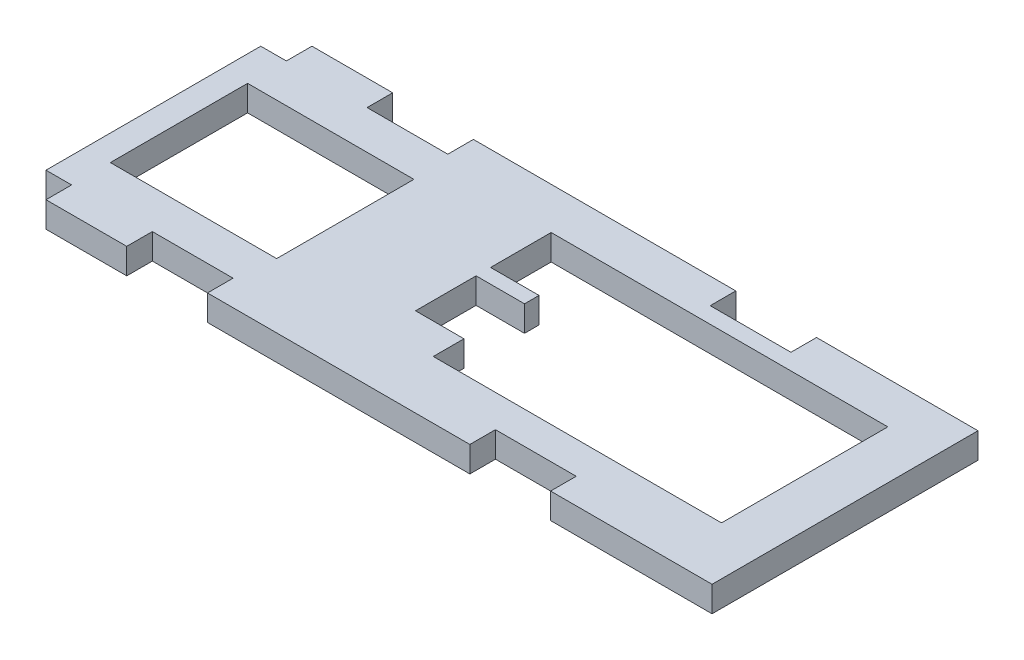
ISO-10303-21;
HEADER;
FILE_DESCRIPTION(('STEP AP214'),'2;1');
FILE_NAME('part.step','',(''),(''),'','','');
FILE_SCHEMA(('AUTOMOTIVE_DESIGN { 1 0 10303 214 1 1 1 1 }'));
ENDSEC;
DATA;
#1=APPLICATION_CONTEXT('core data for automotive mechanical design processes');
#2=APPLICATION_PROTOCOL_DEFINITION('international standard','automotive_design',2000,#1);
#3=PRODUCT_CONTEXT('',#1,'mechanical');
#4=PRODUCT('Part','Part','',(#3));
#5=PRODUCT_RELATED_PRODUCT_CATEGORY('part','',(#4));
#6=PRODUCT_DEFINITION_FORMATION('','',#4);
#7=PRODUCT_DEFINITION_CONTEXT('part definition',#1,'design');
#8=PRODUCT_DEFINITION('design','',#6,#7);
#9=PRODUCT_DEFINITION_SHAPE('','',#8);
#10=(LENGTH_UNIT() NAMED_UNIT(*) SI_UNIT(.MILLI.,.METRE.));
#11=(NAMED_UNIT(*) PLANE_ANGLE_UNIT() SI_UNIT($,.RADIAN.));
#12=(NAMED_UNIT(*) SI_UNIT($,.STERADIAN.) SOLID_ANGLE_UNIT());
#13=UNCERTAINTY_MEASURE_WITH_UNIT(LENGTH_MEASURE(1.E-05),#10,'distance_accuracy_value','');
#14=(GEOMETRIC_REPRESENTATION_CONTEXT(3) GLOBAL_UNCERTAINTY_ASSIGNED_CONTEXT((#13)) GLOBAL_UNIT_ASSIGNED_CONTEXT((#10,
#11,#12)) REPRESENTATION_CONTEXT('',''));
#15=CARTESIAN_POINT('',(0.,0.,0.));
#16=DIRECTION('',(0.,0.,1.));
#17=DIRECTION('',(1.,0.,0.));
#18=AXIS2_PLACEMENT_3D('',#15,#16,#17);
#19=CARTESIAN_POINT('',(0.,-3.17,-20.27));
#20=DIRECTION('',(0.,0.,-1.));
#21=DIRECTION('',(-1.,0.,0.));
#22=AXIS2_PLACEMENT_3D('',#19,#20,#21);
#23=PLANE('',#22);
#24=DIRECTION('',(-1.,0.,0.));
#25=VECTOR('',#24,1.);
#26=CARTESIAN_POINT('',(0.,0.,-20.27));
#27=LINE('',#26,#25);
#28=CARTESIAN_POINT('',(43.97,0.,-20.27));
#29=VERTEX_POINT('',#28);
#30=CARTESIAN_POINT('',(37.97,0.,-20.27));
#31=VERTEX_POINT('',#30);
#32=EDGE_CURVE('E387',#29,#31,#27,.T.);
#33=ORIENTED_EDGE('',*,*,#32,.F.);
#34=DIRECTION('',(0.,1.,0.));
#35=VECTOR('',#34,1.);
#36=CARTESIAN_POINT('',(43.97,-3.17,-20.27));
#37=LINE('',#36,#35);
#38=CARTESIAN_POINT('',(43.97,-3.17,-20.27));
#39=VERTEX_POINT('',#38);
#40=EDGE_CURVE('E11',#39,#29,#37,.T.);
#41=ORIENTED_EDGE('',*,*,#40,.F.);
#42=DIRECTION('',(-1.,0.,0.));
#43=VECTOR('',#42,1.);
#44=CARTESIAN_POINT('',(0.,-3.17,-20.27));
#45=LINE('',#44,#43);
#46=CARTESIAN_POINT('',(37.97,-3.17,-20.27));
#47=VERTEX_POINT('',#46);
#48=EDGE_CURVE('E504',#39,#47,#45,.T.);
#49=ORIENTED_EDGE('',*,*,#48,.T.);
#50=DIRECTION('',(0.,1.,0.));
#51=VECTOR('',#50,1.);
#52=CARTESIAN_POINT('',(37.97,-3.17,-20.27));
#53=LINE('',#52,#51);
#54=EDGE_CURVE('E425',#47,#31,#53,.T.);
#55=ORIENTED_EDGE('',*,*,#54,.T.);
#56=EDGE_LOOP('',(#33,#41,#49,#55));
#57=FACE_BOUND('',#56,.T.);
#58=ADVANCED_FACE('F35',(#57),#23,.T.);
#59=CARTESIAN_POINT('',(43.97,-3.17,0.));
#60=DIRECTION('',(-1.,0.,0.));
#61=DIRECTION('',(0.,0.,1.));
#62=AXIS2_PLACEMENT_3D('',#59,#60,#61);
#63=PLANE('',#62);
#64=DIRECTION('',(0.,0.,1.));
#65=VECTOR('',#64,1.);
#66=CARTESIAN_POINT('',(43.97,0.,0.));
#67=LINE('',#66,#65);
#68=CARTESIAN_POINT('',(43.97,0.,-18.47));
#69=VERTEX_POINT('',#68);
#70=EDGE_CURVE('E406',#29,#69,#67,.T.);
#71=ORIENTED_EDGE('',*,*,#70,.T.);
#72=DIRECTION('',(0.,1.,0.));
#73=VECTOR('',#72,1.);
#74=CARTESIAN_POINT('',(43.97,-3.17,-18.47));
#75=LINE('',#74,#73);
#76=CARTESIAN_POINT('',(43.97,-3.17,-18.47));
#77=VERTEX_POINT('',#76);
#78=EDGE_CURVE('E45',#77,#69,#75,.T.);
#79=ORIENTED_EDGE('',*,*,#78,.F.);
#80=DIRECTION('',(0.,0.,1.));
#81=VECTOR('',#80,1.);
#82=CARTESIAN_POINT('',(43.97,-3.17,0.));
#83=LINE('',#82,#81);
#84=EDGE_CURVE('E297',#39,#77,#83,.T.);
#85=ORIENTED_EDGE('',*,*,#84,.F.);
#86=ORIENTED_EDGE('',*,*,#40,.T.);
#87=EDGE_LOOP('',(#71,#79,#85,#86));
#88=FACE_BOUND('',#87,.T.);
#89=ADVANCED_FACE('F573',(#88),#63,.F.);
#90=CARTESIAN_POINT('',(0.,-3.17,-18.47));
#91=DIRECTION('',(0.,0.,-1.));
#92=DIRECTION('',(-1.,0.,0.));
#93=AXIS2_PLACEMENT_3D('',#90,#91,#92);
#94=PLANE('',#93);
#95=DIRECTION('',(-1.,0.,0.));
#96=VECTOR('',#95,1.);
#97=CARTESIAN_POINT('',(0.,0.,-18.47));
#98=LINE('',#97,#96);
#99=CARTESIAN_POINT('',(37.97,0.,-18.47));
#100=VERTEX_POINT('',#99);
#101=EDGE_CURVE('E172',#69,#100,#98,.T.);
#102=ORIENTED_EDGE('',*,*,#101,.T.);
#103=DIRECTION('',(0.,1.,0.));
#104=VECTOR('',#103,1.);
#105=CARTESIAN_POINT('',(37.97,-3.17,-18.47));
#106=LINE('',#105,#104);
#107=CARTESIAN_POINT('',(37.97,-3.17,-18.47));
#108=VERTEX_POINT('',#107);
#109=EDGE_CURVE('E301',#108,#100,#106,.T.);
#110=ORIENTED_EDGE('',*,*,#109,.F.);
#111=DIRECTION('',(-1.,0.,0.));
#112=VECTOR('',#111,1.);
#113=CARTESIAN_POINT('',(0.,-3.17,-18.47));
#114=LINE('',#113,#112);
#115=EDGE_CURVE('E289',#77,#108,#114,.T.);
#116=ORIENTED_EDGE('',*,*,#115,.F.);
#117=ORIENTED_EDGE('',*,*,#78,.T.);
#118=EDGE_LOOP('',(#102,#110,#116,#117));
#119=FACE_BOUND('',#118,.T.);
#120=ADVANCED_FACE('F302',(#119),#94,.F.);
#121=CARTESIAN_POINT('',(37.97,-3.17,0.));
#122=DIRECTION('',(1.,0.,0.));
#123=DIRECTION('',(0.,0.,-1.));
#124=AXIS2_PLACEMENT_3D('',#121,#122,#123);
#125=PLANE('',#124);
#126=DIRECTION('',(0.,0.,-1.));
#127=VECTOR('',#126,1.);
#128=CARTESIAN_POINT('',(37.97,0.,0.));
#129=LINE('',#128,#127);
#130=CARTESIAN_POINT('',(37.97,0.,-10.97));
#131=VERTEX_POINT('',#130);
#132=EDGE_CURVE('E409',#131,#100,#129,.T.);
#133=ORIENTED_EDGE('',*,*,#132,.F.);
#134=DIRECTION('',(0.,1.,0.));
#135=VECTOR('',#134,1.);
#136=CARTESIAN_POINT('',(37.97,-3.17,-10.97));
#137=LINE('',#136,#135);
#138=CARTESIAN_POINT('',(37.97,-3.17,-10.97));
#139=VERTEX_POINT('',#138);
#140=EDGE_CURVE('E305',#139,#131,#137,.T.);
#141=ORIENTED_EDGE('',*,*,#140,.F.);
#142=DIRECTION('',(0.,0.,-1.));
#143=VECTOR('',#142,1.);
#144=CARTESIAN_POINT('',(37.97,-3.17,0.));
#145=LINE('',#144,#143);
#146=EDGE_CURVE('E295',#139,#108,#145,.T.);
#147=ORIENTED_EDGE('',*,*,#146,.T.);
#148=ORIENTED_EDGE('',*,*,#109,.T.);
#149=EDGE_LOOP('',(#133,#141,#147,#148));
#150=FACE_BOUND('',#149,.T.);
#151=ADVANCED_FACE('F307',(#150),#125,.T.);
#152=CARTESIAN_POINT('',(0.,-3.17,-10.97));
#153=DIRECTION('',(0.,0.,-1.));
#154=DIRECTION('',(-1.,0.,0.));
#155=AXIS2_PLACEMENT_3D('',#152,#153,#154);
#156=PLANE('',#155);
#157=DIRECTION('',(-1.,0.,0.));
#158=VECTOR('',#157,1.);
#159=CARTESIAN_POINT('',(0.,0.,-10.97));
#160=LINE('',#159,#158);
#161=CARTESIAN_POINT('',(43.97,0.,-10.97));
#162=VERTEX_POINT('',#161);
#163=EDGE_CURVE('E405',#162,#131,#160,.T.);
#164=ORIENTED_EDGE('',*,*,#163,.F.);
#165=DIRECTION('',(0.,1.,0.));
#166=VECTOR('',#165,1.);
#167=CARTESIAN_POINT('',(43.97,-3.17,-10.97));
#168=LINE('',#167,#166);
#169=CARTESIAN_POINT('',(43.97,-3.17,-10.97));
#170=VERTEX_POINT('',#169);
#171=EDGE_CURVE('E414',#170,#162,#168,.T.);
#172=ORIENTED_EDGE('',*,*,#171,.F.);
#173=DIRECTION('',(-1.,0.,0.));
#174=VECTOR('',#173,1.);
#175=CARTESIAN_POINT('',(0.,-3.17,-10.97));
#176=LINE('',#175,#174);
#177=EDGE_CURVE('E308',#170,#139,#176,.T.);
#178=ORIENTED_EDGE('',*,*,#177,.T.);
#179=ORIENTED_EDGE('',*,*,#140,.T.);
#180=EDGE_LOOP('',(#164,#172,#178,#179));
#181=FACE_BOUND('',#180,.T.);
#182=ADVANCED_FACE('F592',(#181),#156,.T.);
#183=CARTESIAN_POINT('',(43.97,0.,-7.17));
#184=VERTEX_POINT('',#183);
#185=EDGE_CURVE('E402',#162,#184,#67,.T.);
#186=ORIENTED_EDGE('',*,*,#185,.T.);
#187=DIRECTION('',(0.,1.,0.));
#188=VECTOR('',#187,1.);
#189=CARTESIAN_POINT('',(43.97,-3.17,-7.17));
#190=LINE('',#189,#188);
#191=CARTESIAN_POINT('',(43.97,-3.17,-7.17));
#192=VERTEX_POINT('',#191);
#193=EDGE_CURVE('E416',#192,#184,#190,.T.);
#194=ORIENTED_EDGE('',*,*,#193,.F.);
#195=EDGE_CURVE('E310',#170,#192,#83,.T.);
#196=ORIENTED_EDGE('',*,*,#195,.F.);
#197=ORIENTED_EDGE('',*,*,#171,.T.);
#198=EDGE_LOOP('',(#186,#194,#196,#197));
#199=FACE_BOUND('',#198,.T.);
#200=ADVANCED_FACE('F593',(#199),#63,.F.);
#201=CARTESIAN_POINT('',(0.,-3.17,-7.17));
#202=DIRECTION('',(0.,0.,1.));
#203=DIRECTION('',(1.,0.,0.));
#204=AXIS2_PLACEMENT_3D('',#201,#202,#203);
#205=PLANE('',#204);
#206=DIRECTION('',(1.,0.,0.));
#207=VECTOR('',#206,1.);
#208=CARTESIAN_POINT('',(0.,0.,-7.17));
#209=LINE('',#208,#207);
#210=CARTESIAN_POINT('',(79.67,0.,-7.17));
#211=VERTEX_POINT('',#210);
#212=EDGE_CURVE('E399',#184,#211,#209,.T.);
#213=ORIENTED_EDGE('',*,*,#212,.T.);
#214=DIRECTION('',(0.,1.,0.));
#215=VECTOR('',#214,1.);
#216=CARTESIAN_POINT('',(79.67,-3.17,-7.17));
#217=LINE('',#216,#215);
#218=CARTESIAN_POINT('',(79.67,-3.17,-7.17));
#219=VERTEX_POINT('',#218);
#220=EDGE_CURVE('E419',#219,#211,#217,.T.);
#221=ORIENTED_EDGE('',*,*,#220,.F.);
#222=DIRECTION('',(1.,0.,0.));
#223=VECTOR('',#222,1.);
#224=CARTESIAN_POINT('',(0.,-3.17,-7.17));
#225=LINE('',#224,#223);
#226=EDGE_CURVE('E490',#192,#219,#225,.T.);
#227=ORIENTED_EDGE('',*,*,#226,.F.);
#228=ORIENTED_EDGE('',*,*,#193,.T.);
#229=EDGE_LOOP('',(#213,#221,#227,#228));
#230=FACE_BOUND('',#229,.T.);
#231=ADVANCED_FACE('F587',(#230),#205,.F.);
#232=CARTESIAN_POINT('',(79.67,-3.17,0.));
#233=DIRECTION('',(-1.,0.,0.));
#234=DIRECTION('',(0.,0.,1.));
#235=AXIS2_PLACEMENT_3D('',#232,#233,#234);
#236=PLANE('',#235);
#237=DIRECTION('',(0.,0.,1.));
#238=VECTOR('',#237,1.);
#239=CARTESIAN_POINT('',(79.67,0.,0.));
#240=LINE('',#239,#238);
#241=CARTESIAN_POINT('',(79.67,0.,-27.77));
#242=VERTEX_POINT('',#241);
#243=EDGE_CURVE('E396',#242,#211,#240,.T.);
#244=ORIENTED_EDGE('',*,*,#243,.F.);
#245=DIRECTION('',(0.,1.,0.));
#246=VECTOR('',#245,1.);
#247=CARTESIAN_POINT('',(79.67,-3.17,-27.77));
#248=LINE('',#247,#246);
#249=CARTESIAN_POINT('',(79.67,-3.17,-27.77));
#250=VERTEX_POINT('',#249);
#251=EDGE_CURVE('E421',#250,#242,#248,.T.);
#252=ORIENTED_EDGE('',*,*,#251,.F.);
#253=DIRECTION('',(0.,0.,1.));
#254=VECTOR('',#253,1.);
#255=CARTESIAN_POINT('',(79.67,-3.17,0.));
#256=LINE('',#255,#254);
#257=EDGE_CURVE('E493',#250,#219,#256,.T.);
#258=ORIENTED_EDGE('',*,*,#257,.T.);
#259=ORIENTED_EDGE('',*,*,#220,.T.);
#260=EDGE_LOOP('',(#244,#252,#258,#259));
#261=FACE_BOUND('',#260,.T.);
#262=ADVANCED_FACE('F584',(#261),#236,.T.);
#263=CARTESIAN_POINT('',(0.,-3.17,-27.77));
#264=DIRECTION('',(0.,0.,-1.));
#265=DIRECTION('',(-1.,0.,0.));
#266=AXIS2_PLACEMENT_3D('',#263,#264,#265);
#267=PLANE('',#266);
#268=DIRECTION('',(-1.,0.,0.));
#269=VECTOR('',#268,1.);
#270=CARTESIAN_POINT('',(0.,0.,-27.77));
#271=LINE('',#270,#269);
#272=CARTESIAN_POINT('',(37.97,0.,-27.77));
#273=VERTEX_POINT('',#272);
#274=EDGE_CURVE('E393',#242,#273,#271,.T.);
#275=ORIENTED_EDGE('',*,*,#274,.T.);
#276=DIRECTION('',(0.,1.,0.));
#277=VECTOR('',#276,1.);
#278=CARTESIAN_POINT('',(37.97,-3.17,-27.77));
#279=LINE('',#278,#277);
#280=CARTESIAN_POINT('',(37.97,-3.17,-27.77));
#281=VERTEX_POINT('',#280);
#282=EDGE_CURVE('E423',#281,#273,#279,.T.);
#283=ORIENTED_EDGE('',*,*,#282,.F.);
#284=DIRECTION('',(-1.,0.,0.));
#285=VECTOR('',#284,1.);
#286=CARTESIAN_POINT('',(0.,-3.17,-27.77));
#287=LINE('',#286,#285);
#288=EDGE_CURVE('E497',#250,#281,#287,.T.);
#289=ORIENTED_EDGE('',*,*,#288,.F.);
#290=ORIENTED_EDGE('',*,*,#251,.T.);
#291=EDGE_LOOP('',(#275,#283,#289,#290));
#292=FACE_BOUND('',#291,.T.);
#293=ADVANCED_FACE('F629',(#292),#267,.F.);
#294=CARTESIAN_POINT('',(0.,-3.17,-24.97));
#295=DIRECTION('',(0.,0.,1.));
#296=DIRECTION('',(1.,0.,0.));
#297=AXIS2_PLACEMENT_3D('',#294,#295,#296);
#298=PLANE('',#297);
#299=DIRECTION('',(1.,0.,0.));
#300=VECTOR('',#299,1.);
#301=CARTESIAN_POINT('',(0.,0.,-24.97));
#302=LINE('',#301,#300);
#303=CARTESIAN_POINT('',(3.17,0.,-24.97));
#304=VERTEX_POINT('',#303);
#305=CARTESIAN_POINT('',(23.77,0.,-24.97));
#306=VERTEX_POINT('',#305);
#307=EDGE_CURVE('E375',#304,#306,#302,.T.);
#308=ORIENTED_EDGE('',*,*,#307,.F.);
#309=DIRECTION('',(0.,1.,0.));
#310=VECTOR('',#309,1.);
#311=CARTESIAN_POINT('',(3.17,-3.17,-24.97));
#312=LINE('',#311,#310);
#313=CARTESIAN_POINT('',(3.17,-3.17,-24.97));
#314=VERTEX_POINT('',#313);
#315=EDGE_CURVE('E427',#314,#304,#312,.T.);
#316=ORIENTED_EDGE('',*,*,#315,.F.);
#317=DIRECTION('',(1.,0.,0.));
#318=VECTOR('',#317,1.);
#319=CARTESIAN_POINT('',(0.,-3.17,-24.97));
#320=LINE('',#319,#318);
#321=CARTESIAN_POINT('',(23.77,-3.17,-24.97));
#322=VERTEX_POINT('',#321);
#323=EDGE_CURVE('E514',#314,#322,#320,.T.);
#324=ORIENTED_EDGE('',*,*,#323,.T.);
#325=DIRECTION('',(0.,1.,0.));
#326=VECTOR('',#325,1.);
#327=CARTESIAN_POINT('',(23.77,-3.17,-24.97));
#328=LINE('',#327,#326);
#329=EDGE_CURVE('E434',#322,#306,#328,.T.);
#330=ORIENTED_EDGE('',*,*,#329,.T.);
#331=EDGE_LOOP('',(#308,#316,#324,#330));
#332=FACE_BOUND('',#331,.T.);
#333=ADVANCED_FACE('F616',(#332),#298,.T.);
#334=CARTESIAN_POINT('',(3.17,-3.17,0.));
#335=DIRECTION('',(-1.,0.,0.));
#336=DIRECTION('',(0.,0.,1.));
#337=AXIS2_PLACEMENT_3D('',#334,#335,#336);
#338=PLANE('',#337);
#339=DIRECTION('',(0.,0.,1.));
#340=VECTOR('',#339,1.);
#341=CARTESIAN_POINT('',(3.17,0.,0.));
#342=LINE('',#341,#340);
#343=CARTESIAN_POINT('',(3.17,0.,-7.97));
#344=VERTEX_POINT('',#343);
#345=EDGE_CURVE('E384',#304,#344,#342,.T.);
#346=ORIENTED_EDGE('',*,*,#345,.T.);
#347=DIRECTION('',(0.,1.,0.));
#348=VECTOR('',#347,1.);
#349=CARTESIAN_POINT('',(3.17,-3.17,-7.97));
#350=LINE('',#349,#348);
#351=CARTESIAN_POINT('',(3.17,-3.17,-7.97));
#352=VERTEX_POINT('',#351);
#353=EDGE_CURVE('E429',#352,#344,#350,.T.);
#354=ORIENTED_EDGE('',*,*,#353,.F.);
#355=DIRECTION('',(0.,0.,1.));
#356=VECTOR('',#355,1.);
#357=CARTESIAN_POINT('',(3.17,-3.17,0.));
#358=LINE('',#357,#356);
#359=EDGE_CURVE('E506',#314,#352,#358,.T.);
#360=ORIENTED_EDGE('',*,*,#359,.F.);
#361=ORIENTED_EDGE('',*,*,#315,.T.);
#362=EDGE_LOOP('',(#346,#354,#360,#361));
#363=FACE_BOUND('',#362,.T.);
#364=ADVANCED_FACE('F612',(#363),#338,.F.);
#365=CARTESIAN_POINT('',(0.,-3.17,-7.97));
#366=DIRECTION('',(0.,0.,1.));
#367=DIRECTION('',(1.,0.,0.));
#368=AXIS2_PLACEMENT_3D('',#365,#366,#367);
#369=PLANE('',#368);
#370=DIRECTION('',(1.,0.,0.));
#371=VECTOR('',#370,1.);
#372=CARTESIAN_POINT('',(0.,0.,-7.97));
#373=LINE('',#372,#371);
#374=CARTESIAN_POINT('',(23.77,0.,-7.97));
#375=VERTEX_POINT('',#374);
#376=EDGE_CURVE('E381',#344,#375,#373,.T.);
#377=ORIENTED_EDGE('',*,*,#376,.T.);
#378=DIRECTION('',(0.,1.,0.));
#379=VECTOR('',#378,1.);
#380=CARTESIAN_POINT('',(23.77,-3.17,-7.97));
#381=LINE('',#380,#379);
#382=CARTESIAN_POINT('',(23.77,-3.17,-7.97));
#383=VERTEX_POINT('',#382);
#384=EDGE_CURVE('E432',#383,#375,#381,.T.);
#385=ORIENTED_EDGE('',*,*,#384,.F.);
#386=DIRECTION('',(1.,0.,0.));
#387=VECTOR('',#386,1.);
#388=CARTESIAN_POINT('',(0.,-3.17,-7.97));
#389=LINE('',#388,#387);
#390=EDGE_CURVE('E509',#352,#383,#389,.T.);
#391=ORIENTED_EDGE('',*,*,#390,.F.);
#392=ORIENTED_EDGE('',*,*,#353,.T.);
#393=EDGE_LOOP('',(#377,#385,#391,#392));
#394=FACE_BOUND('',#393,.T.);
#395=ADVANCED_FACE('F615',(#394),#369,.F.);
#396=CARTESIAN_POINT('',(3.17,-3.17,0.));
#397=DIRECTION('',(1.,0.,0.));
#398=DIRECTION('',(0.,0.,-1.));
#399=AXIS2_PLACEMENT_3D('',#396,#397,#398);
#400=PLANE('',#399);
#401=DIRECTION('',(0.,0.,-1.));
#402=VECTOR('',#401,1.);
#403=CARTESIAN_POINT('',(3.17,0.,0.));
#404=LINE('',#403,#402);
#405=CARTESIAN_POINT('',(3.17,0.,0.));
#406=VERTEX_POINT('',#405);
#407=CARTESIAN_POINT('',(3.17,0.,-3.17));
#408=VERTEX_POINT('',#407);
#409=EDGE_CURVE('E314',#406,#408,#404,.T.);
#410=ORIENTED_EDGE('',*,*,#409,.T.);
#411=DIRECTION('',(0.,1.,0.));
#412=VECTOR('',#411,1.);
#413=CARTESIAN_POINT('',(3.17,-3.17,-3.17));
#414=LINE('',#413,#412);
#415=CARTESIAN_POINT('',(3.17,-3.17,-3.17));
#416=VERTEX_POINT('',#415);
#417=EDGE_CURVE('E436',#416,#408,#414,.T.);
#418=ORIENTED_EDGE('',*,*,#417,.F.);
#419=DIRECTION('',(0.,0.,-1.));
#420=VECTOR('',#419,1.);
#421=CARTESIAN_POINT('',(3.17,-3.17,0.));
#422=LINE('',#421,#420);
#423=CARTESIAN_POINT('',(3.17,-3.17,0.));
#424=VERTEX_POINT('',#423);
#425=EDGE_CURVE('E568',#424,#416,#422,.T.);
#426=ORIENTED_EDGE('',*,*,#425,.F.);
#427=DIRECTION('',(0.,1.,0.));
#428=VECTOR('',#427,1.);
#429=CARTESIAN_POINT('',(3.17,-3.17,0.));
#430=LINE('',#429,#428);
#431=EDGE_CURVE('E39',#424,#406,#430,.T.);
#432=ORIENTED_EDGE('',*,*,#431,.T.);
#433=EDGE_LOOP('',(#410,#418,#426,#432));
#434=FACE_BOUND('',#433,.T.);
#435=ADVANCED_FACE('F37',(#434),#400,.F.);
#436=CARTESIAN_POINT('',(0.,-3.17,-3.17));
#437=DIRECTION('',(0.,0.,1.));
#438=DIRECTION('',(1.,0.,0.));
#439=AXIS2_PLACEMENT_3D('',#436,#437,#438);
#440=PLANE('',#439);
#441=DIRECTION('',(1.,0.,0.));
#442=VECTOR('',#441,1.);
#443=CARTESIAN_POINT('',(0.,0.,-3.17));
#444=LINE('',#443,#442);
#445=CARTESIAN_POINT('',(0.,0.,-3.17));
#446=VERTEX_POINT('',#445);
#447=EDGE_CURVE('E372',#446,#408,#444,.T.);
#448=ORIENTED_EDGE('',*,*,#447,.F.);
#449=DIRECTION('',(0.,1.,0.));
#450=VECTOR('',#449,1.);
#451=CARTESIAN_POINT('',(0.,-3.17,-3.17));
#452=LINE('',#451,#450);
#453=CARTESIAN_POINT('',(0.,-3.17,-3.17));
#454=VERTEX_POINT('',#453);
#455=EDGE_CURVE('E438',#454,#446,#452,.T.);
#456=ORIENTED_EDGE('',*,*,#455,.F.);
#457=DIRECTION('',(1.,0.,0.));
#458=VECTOR('',#457,1.);
#459=CARTESIAN_POINT('',(0.,-3.17,-3.17));
#460=LINE('',#459,#458);
#461=EDGE_CURVE('E517',#454,#416,#460,.T.);
#462=ORIENTED_EDGE('',*,*,#461,.T.);
#463=ORIENTED_EDGE('',*,*,#417,.T.);
#464=EDGE_LOOP('',(#448,#456,#462,#463));
#465=FACE_BOUND('',#464,.T.);
#466=ADVANCED_FACE('F631',(#465),#440,.T.);
#467=CARTESIAN_POINT('',(0.,-3.17,0.));
#468=DIRECTION('',(1.,0.,0.));
#469=DIRECTION('',(0.,0.,-1.));
#470=AXIS2_PLACEMENT_3D('',#467,#468,#469);
#471=PLANE('',#470);
#472=DIRECTION('',(0.,0.,-1.));
#473=VECTOR('',#472,1.);
#474=CARTESIAN_POINT('',(0.,0.,0.));
#475=LINE('',#474,#473);
#476=CARTESIAN_POINT('',(0.,0.,-29.77));
#477=VERTEX_POINT('',#476);
#478=EDGE_CURVE('E370',#446,#477,#475,.T.);
#479=ORIENTED_EDGE('',*,*,#478,.T.);
#480=DIRECTION('',(0.,1.,0.));
#481=VECTOR('',#480,1.);
#482=CARTESIAN_POINT('',(0.,-3.17,-29.77));
#483=LINE('',#482,#481);
#484=CARTESIAN_POINT('',(0.,-3.17,-29.77));
#485=VERTEX_POINT('',#484);
#486=EDGE_CURVE('E440',#485,#477,#483,.T.);
#487=ORIENTED_EDGE('',*,*,#486,.F.);
#488=DIRECTION('',(0.,0.,-1.));
#489=VECTOR('',#488,1.);
#490=CARTESIAN_POINT('',(0.,-3.17,0.));
#491=LINE('',#490,#489);
#492=EDGE_CURVE('E520',#454,#485,#491,.T.);
#493=ORIENTED_EDGE('',*,*,#492,.F.);
#494=ORIENTED_EDGE('',*,*,#455,.T.);
#495=EDGE_LOOP('',(#479,#487,#493,#494));
#496=FACE_BOUND('',#495,.T.);
#497=ADVANCED_FACE('F634',(#496),#471,.F.);
#498=CARTESIAN_POINT('',(0.,-3.17,-29.77));
#499=DIRECTION('',(0.,0.,1.));
#500=DIRECTION('',(1.,0.,0.));
#501=AXIS2_PLACEMENT_3D('',#498,#499,#500);
#502=PLANE('',#501);
#503=DIRECTION('',(1.,0.,0.));
#504=VECTOR('',#503,1.);
#505=CARTESIAN_POINT('',(0.,0.,-29.77));
#506=LINE('',#505,#504);
#507=CARTESIAN_POINT('',(3.17,0.,-29.77));
#508=VERTEX_POINT('',#507);
#509=EDGE_CURVE('E367',#477,#508,#506,.T.);
#510=ORIENTED_EDGE('',*,*,#509,.T.);
#511=DIRECTION('',(0.,1.,0.));
#512=VECTOR('',#511,1.);
#513=CARTESIAN_POINT('',(3.17,-3.17,-29.77));
#514=LINE('',#513,#512);
#515=CARTESIAN_POINT('',(3.17,-3.17,-29.77));
#516=VERTEX_POINT('',#515);
#517=EDGE_CURVE('E443',#516,#508,#514,.T.);
#518=ORIENTED_EDGE('',*,*,#517,.F.);
#519=DIRECTION('',(1.,0.,0.));
#520=VECTOR('',#519,1.);
#521=CARTESIAN_POINT('',(0.,-3.17,-29.77));
#522=LINE('',#521,#520);
#523=EDGE_CURVE('E522',#485,#516,#522,.T.);
#524=ORIENTED_EDGE('',*,*,#523,.F.);
#525=ORIENTED_EDGE('',*,*,#486,.T.);
#526=EDGE_LOOP('',(#510,#518,#524,#525));
#527=FACE_BOUND('',#526,.T.);
#528=ADVANCED_FACE('F638',(#527),#502,.F.);
#529=CARTESIAN_POINT('',(3.17,-3.17,0.));
#530=DIRECTION('',(-1.,0.,0.));
#531=DIRECTION('',(0.,0.,1.));
#532=AXIS2_PLACEMENT_3D('',#529,#530,#531);
#533=PLANE('',#532);
#534=DIRECTION('',(0.,0.,1.));
#535=VECTOR('',#534,1.);
#536=CARTESIAN_POINT('',(3.17,0.,0.));
#537=LINE('',#536,#535);
#538=CARTESIAN_POINT('',(3.17,0.,-32.94));
#539=VERTEX_POINT('',#538);
#540=EDGE_CURVE('E364',#539,#508,#537,.T.);
#541=ORIENTED_EDGE('',*,*,#540,.F.);
#542=DIRECTION('',(0.,1.,0.));
#543=VECTOR('',#542,1.);
#544=CARTESIAN_POINT('',(3.17,-3.17,-32.94));
#545=LINE('',#544,#543);
#546=CARTESIAN_POINT('',(3.17,-3.17,-32.94));
#547=VERTEX_POINT('',#546);
#548=EDGE_CURVE('E445',#547,#539,#545,.T.);
#549=ORIENTED_EDGE('',*,*,#548,.F.);
#550=DIRECTION('',(0.,0.,1.));
#551=VECTOR('',#550,1.);
#552=CARTESIAN_POINT('',(3.17,-3.17,0.));
#553=LINE('',#552,#551);
#554=EDGE_CURVE('E524',#547,#516,#553,.T.);
#555=ORIENTED_EDGE('',*,*,#554,.T.);
#556=ORIENTED_EDGE('',*,*,#517,.T.);
#557=EDGE_LOOP('',(#541,#549,#555,#556));
#558=FACE_BOUND('',#557,.T.);
#559=ADVANCED_FACE('F642',(#558),#533,.T.);
#560=CARTESIAN_POINT('',(0.,-3.17,-32.94));
#561=DIRECTION('',(0.,0.,1.));
#562=DIRECTION('',(1.,0.,0.));
#563=AXIS2_PLACEMENT_3D('',#560,#561,#562);
#564=PLANE('',#563);
#565=DIRECTION('',(1.,0.,0.));
#566=VECTOR('',#565,1.);
#567=CARTESIAN_POINT('',(0.,0.,-32.94));
#568=LINE('',#567,#566);
#569=CARTESIAN_POINT('',(13.17,0.,-32.94));
#570=VERTEX_POINT('',#569);
#571=EDGE_CURVE('E347',#539,#570,#568,.T.);
#572=ORIENTED_EDGE('',*,*,#571,.T.);
#573=DIRECTION('',(0.,1.,0.));
#574=VECTOR('',#573,1.);
#575=CARTESIAN_POINT('',(13.17,-3.17,-32.94));
#576=LINE('',#575,#574);
#577=CARTESIAN_POINT('',(13.17,-3.17,-32.94));
#578=VERTEX_POINT('',#577);
#579=EDGE_CURVE('E447',#578,#570,#576,.T.);
#580=ORIENTED_EDGE('',*,*,#579,.F.);
#581=DIRECTION('',(1.,0.,0.));
#582=VECTOR('',#581,1.);
#583=CARTESIAN_POINT('',(0.,-3.17,-32.94));
#584=LINE('',#583,#582);
#585=EDGE_CURVE('E527',#547,#578,#584,.T.);
#586=ORIENTED_EDGE('',*,*,#585,.F.);
#587=ORIENTED_EDGE('',*,*,#548,.T.);
#588=EDGE_LOOP('',(#572,#580,#586,#587));
#589=FACE_BOUND('',#588,.T.);
#590=ADVANCED_FACE('F646',(#589),#564,.F.);
#591=CARTESIAN_POINT('',(13.17,-3.17,0.));
#592=DIRECTION('',(-1.,0.,0.));
#593=DIRECTION('',(0.,0.,1.));
#594=AXIS2_PLACEMENT_3D('',#591,#592,#593);
#595=PLANE('',#594);
#596=DIRECTION('',(0.,0.,1.));
#597=VECTOR('',#596,1.);
#598=CARTESIAN_POINT('',(13.17,0.,0.));
#599=LINE('',#598,#597);
#600=CARTESIAN_POINT('',(13.17,0.,-29.77));
#601=VERTEX_POINT('',#600);
#602=EDGE_CURVE('E362',#570,#601,#599,.T.);
#603=ORIENTED_EDGE('',*,*,#602,.T.);
#604=DIRECTION('',(0.,1.,0.));
#605=VECTOR('',#604,1.);
#606=CARTESIAN_POINT('',(13.17,-3.17,-29.77));
#607=LINE('',#606,#605);
#608=CARTESIAN_POINT('',(13.17,-3.17,-29.77));
#609=VERTEX_POINT('',#608);
#610=EDGE_CURVE('E450',#609,#601,#607,.T.);
#611=ORIENTED_EDGE('',*,*,#610,.F.);
#612=DIRECTION('',(0.,0.,1.));
#613=VECTOR('',#612,1.);
#614=CARTESIAN_POINT('',(13.17,-3.17,0.));
#615=LINE('',#614,#613);
#616=EDGE_CURVE('E528',#578,#609,#615,.T.);
#617=ORIENTED_EDGE('',*,*,#616,.F.);
#618=ORIENTED_EDGE('',*,*,#579,.T.);
#619=EDGE_LOOP('',(#603,#611,#617,#618));
#620=FACE_BOUND('',#619,.T.);
#621=ADVANCED_FACE('F650',(#620),#595,.F.);
#622=CARTESIAN_POINT('',(0.,-3.17,-29.77));
#623=DIRECTION('',(0.,0.,1.));
#624=DIRECTION('',(1.,0.,0.));
#625=AXIS2_PLACEMENT_3D('',#622,#623,#624);
#626=PLANE('',#625);
#627=DIRECTION('',(1.,0.,0.));
#628=VECTOR('',#627,1.);
#629=CARTESIAN_POINT('',(0.,0.,-29.77));
#630=LINE('',#629,#628);
#631=CARTESIAN_POINT('',(23.17,0.,-29.77));
#632=VERTEX_POINT('',#631);
#633=EDGE_CURVE('E359',#601,#632,#630,.T.);
#634=ORIENTED_EDGE('',*,*,#633,.T.);
#635=DIRECTION('',(0.,1.,0.));
#636=VECTOR('',#635,1.);
#637=CARTESIAN_POINT('',(23.17,-3.17,-29.77));
#638=LINE('',#637,#636);
#639=CARTESIAN_POINT('',(23.17,-3.17,-29.77));
#640=VERTEX_POINT('',#639);
#641=EDGE_CURVE('E453',#640,#632,#638,.T.);
#642=ORIENTED_EDGE('',*,*,#641,.F.);
#643=DIRECTION('',(1.,0.,0.));
#644=VECTOR('',#643,1.);
#645=CARTESIAN_POINT('',(0.,-3.17,-29.77));
#646=LINE('',#645,#644);
#647=EDGE_CURVE('E530',#609,#640,#646,.T.);
#648=ORIENTED_EDGE('',*,*,#647,.F.);
#649=ORIENTED_EDGE('',*,*,#610,.T.);
#650=EDGE_LOOP('',(#634,#642,#648,#649));
#651=FACE_BOUND('',#650,.T.);
#652=ADVANCED_FACE('F656',(#651),#626,.F.);
#653=CARTESIAN_POINT('',(23.17,-3.17,0.));
#654=DIRECTION('',(-1.,0.,0.));
#655=DIRECTION('',(0.,0.,1.));
#656=AXIS2_PLACEMENT_3D('',#653,#654,#655);
#657=PLANE('',#656);
#658=DIRECTION('',(0.,0.,1.));
#659=VECTOR('',#658,1.);
#660=CARTESIAN_POINT('',(23.17,0.,0.));
#661=LINE('',#660,#659);
#662=CARTESIAN_POINT('',(23.17,0.,-32.94));
#663=VERTEX_POINT('',#662);
#664=EDGE_CURVE('E356',#663,#632,#661,.T.);
#665=ORIENTED_EDGE('',*,*,#664,.F.);
#666=DIRECTION('',(0.,1.,0.));
#667=VECTOR('',#666,1.);
#668=CARTESIAN_POINT('',(23.17,-3.17,-32.94));
#669=LINE('',#668,#667);
#670=CARTESIAN_POINT('',(23.17,-3.17,-32.94));
#671=VERTEX_POINT('',#670);
#672=EDGE_CURVE('E455',#671,#663,#669,.T.);
#673=ORIENTED_EDGE('',*,*,#672,.F.);
#674=DIRECTION('',(0.,0.,1.));
#675=VECTOR('',#674,1.);
#676=CARTESIAN_POINT('',(23.17,-3.17,0.));
#677=LINE('',#676,#675);
#678=EDGE_CURVE('E532',#671,#640,#677,.T.);
#679=ORIENTED_EDGE('',*,*,#678,.T.);
#680=ORIENTED_EDGE('',*,*,#641,.T.);
#681=EDGE_LOOP('',(#665,#673,#679,#680));
#682=FACE_BOUND('',#681,.T.);
#683=ADVANCED_FACE('F660',(#682),#657,.T.);
#684=CARTESIAN_POINT('',(55.67,0.,-32.94));
#685=VERTEX_POINT('',#684);
#686=EDGE_CURVE('E348',#663,#685,#568,.T.);
#687=ORIENTED_EDGE('',*,*,#686,.T.);
#688=DIRECTION('',(0.,1.,0.));
#689=VECTOR('',#688,1.);
#690=CARTESIAN_POINT('',(55.67,-3.17,-32.94));
#691=LINE('',#690,#689);
#692=CARTESIAN_POINT('',(55.67,-3.17,-32.94));
#693=VERTEX_POINT('',#692);
#694=EDGE_CURVE('E457',#693,#685,#691,.T.);
#695=ORIENTED_EDGE('',*,*,#694,.F.);
#696=EDGE_CURVE('E535',#671,#693,#584,.T.);
#697=ORIENTED_EDGE('',*,*,#696,.F.);
#698=ORIENTED_EDGE('',*,*,#672,.T.);
#699=EDGE_LOOP('',(#687,#695,#697,#698));
#700=FACE_BOUND('',#699,.T.);
#701=ADVANCED_FACE('F653',(#700),#564,.F.);
#702=CARTESIAN_POINT('',(55.6699999999999,-3.17,1.21857483795115E-13));
#703=DIRECTION('',(-1.,0.,0.));
#704=DIRECTION('',(0.,0.,1.));
#705=AXIS2_PLACEMENT_3D('',#702,#703,#704);
#706=PLANE('',#705);
#707=DIRECTION('',(0.,0.,1.));
#708=VECTOR('',#707,1.);
#709=CARTESIAN_POINT('',(55.6699999999999,0.,1.21857483795115E-13));
#710=LINE('',#709,#708);
#711=CARTESIAN_POINT('',(55.67,0.,-29.77));
#712=VERTEX_POINT('',#711);
#713=EDGE_CURVE('E354',#685,#712,#710,.T.);
#714=ORIENTED_EDGE('',*,*,#713,.T.);
#715=DIRECTION('',(0.,1.,0.));
#716=VECTOR('',#715,1.);
#717=CARTESIAN_POINT('',(55.67,-3.17,-29.77));
#718=LINE('',#717,#716);
#719=CARTESIAN_POINT('',(55.67,-3.17,-29.77));
#720=VERTEX_POINT('',#719);
#721=EDGE_CURVE('E460',#720,#712,#718,.T.);
#722=ORIENTED_EDGE('',*,*,#721,.F.);
#723=DIRECTION('',(0.,0.,1.));
#724=VECTOR('',#723,1.);
#725=CARTESIAN_POINT('',(55.6699999999999,-3.17,1.21857483795115E-13));
#726=LINE('',#725,#724);
#727=EDGE_CURVE('E536',#693,#720,#726,.T.);
#728=ORIENTED_EDGE('',*,*,#727,.F.);
#729=ORIENTED_EDGE('',*,*,#694,.T.);
#730=EDGE_LOOP('',(#714,#722,#728,#729));
#731=FACE_BOUND('',#730,.T.);
#732=ADVANCED_FACE('F665',(#731),#706,.F.);
#733=CARTESIAN_POINT('',(0.,-3.17,-29.77));
#734=DIRECTION('',(0.,0.,1.));
#735=DIRECTION('',(1.,0.,0.));
#736=AXIS2_PLACEMENT_3D('',#733,#734,#735);
#737=PLANE('',#736);
#738=DIRECTION('',(1.,0.,0.));
#739=VECTOR('',#738,1.);
#740=CARTESIAN_POINT('',(0.,0.,-29.77));
#741=LINE('',#740,#739);
#742=CARTESIAN_POINT('',(65.67,0.,-29.77));
#743=VERTEX_POINT('',#742);
#744=EDGE_CURVE('E351',#712,#743,#741,.T.);
#745=ORIENTED_EDGE('',*,*,#744,.T.);
#746=DIRECTION('',(0.,1.,0.));
#747=VECTOR('',#746,1.);
#748=CARTESIAN_POINT('',(65.67,-3.17,-29.77));
#749=LINE('',#748,#747);
#750=CARTESIAN_POINT('',(65.67,-3.17,-29.77));
#751=VERTEX_POINT('',#750);
#752=EDGE_CURVE('E463',#751,#743,#749,.T.);
#753=ORIENTED_EDGE('',*,*,#752,.F.);
#754=DIRECTION('',(1.,0.,0.));
#755=VECTOR('',#754,1.);
#756=CARTESIAN_POINT('',(0.,-3.17,-29.77));
#757=LINE('',#756,#755);
#758=EDGE_CURVE('E538',#720,#751,#757,.T.);
#759=ORIENTED_EDGE('',*,*,#758,.F.);
#760=ORIENTED_EDGE('',*,*,#721,.T.);
#761=EDGE_LOOP('',(#745,#753,#759,#760));
#762=FACE_BOUND('',#761,.T.);
#763=ADVANCED_FACE('F668',(#762),#737,.F.);
#764=CARTESIAN_POINT('',(65.67,-3.17,0.));
#765=DIRECTION('',(-1.,0.,0.));
#766=DIRECTION('',(0.,0.,1.));
#767=AXIS2_PLACEMENT_3D('',#764,#765,#766);
#768=PLANE('',#767);
#769=DIRECTION('',(0.,0.,1.));
#770=VECTOR('',#769,1.);
#771=CARTESIAN_POINT('',(65.67,0.,0.));
#772=LINE('',#771,#770);
#773=CARTESIAN_POINT('',(65.67,0.,-32.94));
#774=VERTEX_POINT('',#773);
#775=EDGE_CURVE('E346',#774,#743,#772,.T.);
#776=ORIENTED_EDGE('',*,*,#775,.F.);
#777=DIRECTION('',(0.,1.,0.));
#778=VECTOR('',#777,1.);
#779=CARTESIAN_POINT('',(65.67,-3.17,-32.94));
#780=LINE('',#779,#778);
#781=CARTESIAN_POINT('',(65.67,-3.17,-32.94));
#782=VERTEX_POINT('',#781);
#783=EDGE_CURVE('E465',#782,#774,#780,.T.);
#784=ORIENTED_EDGE('',*,*,#783,.F.);
#785=DIRECTION('',(0.,0.,1.));
#786=VECTOR('',#785,1.);
#787=CARTESIAN_POINT('',(65.67,-3.17,0.));
#788=LINE('',#787,#786);
#789=EDGE_CURVE('E540',#782,#751,#788,.T.);
#790=ORIENTED_EDGE('',*,*,#789,.T.);
#791=ORIENTED_EDGE('',*,*,#752,.T.);
#792=EDGE_LOOP('',(#776,#784,#790,#791));
#793=FACE_BOUND('',#792,.T.);
#794=ADVANCED_FACE('F672',(#793),#768,.T.);
#795=CARTESIAN_POINT('',(85.67,0.,-32.94));
#796=VERTEX_POINT('',#795);
#797=EDGE_CURVE('E343',#774,#796,#568,.T.);
#798=ORIENTED_EDGE('',*,*,#797,.T.);
#799=DIRECTION('',(0.,1.,0.));
#800=VECTOR('',#799,1.);
#801=CARTESIAN_POINT('',(85.67,-3.17,-32.94));
#802=LINE('',#801,#800);
#803=CARTESIAN_POINT('',(85.67,-3.17,-32.94));
#804=VERTEX_POINT('',#803);
#805=EDGE_CURVE('E467',#804,#796,#802,.T.);
#806=ORIENTED_EDGE('',*,*,#805,.F.);
#807=EDGE_CURVE('E543',#782,#804,#584,.T.);
#808=ORIENTED_EDGE('',*,*,#807,.F.);
#809=ORIENTED_EDGE('',*,*,#783,.T.);
#810=EDGE_LOOP('',(#798,#806,#808,#809));
#811=FACE_BOUND('',#810,.T.);
#812=ADVANCED_FACE('F652',(#811),#564,.F.);
#813=CARTESIAN_POINT('',(85.67,-3.17,0.));
#814=DIRECTION('',(1.,0.,0.));
#815=DIRECTION('',(0.,0.,-1.));
#816=AXIS2_PLACEMENT_3D('',#813,#814,#815);
#817=PLANE('',#816);
#818=DIRECTION('',(0.,0.,-1.));
#819=VECTOR('',#818,1.);
#820=CARTESIAN_POINT('',(85.67,0.,0.));
#821=LINE('',#820,#819);
#822=CARTESIAN_POINT('',(85.67,0.,0.));
#823=VERTEX_POINT('',#822);
#824=EDGE_CURVE('E340',#823,#796,#821,.T.);
#825=ORIENTED_EDGE('',*,*,#824,.F.);
#826=DIRECTION('',(0.,1.,0.));
#827=VECTOR('',#826,1.);
#828=CARTESIAN_POINT('',(85.67,-3.17,0.));
#829=LINE('',#828,#827);
#830=CARTESIAN_POINT('',(85.67,-3.17,0.));
#831=VERTEX_POINT('',#830);
#832=EDGE_CURVE('E469',#831,#823,#829,.T.);
#833=ORIENTED_EDGE('',*,*,#832,.F.);
#834=DIRECTION('',(0.,0.,-1.));
#835=VECTOR('',#834,1.);
#836=CARTESIAN_POINT('',(85.67,-3.17,0.));
#837=LINE('',#836,#835);
#838=EDGE_CURVE('E545',#831,#804,#837,.T.);
#839=ORIENTED_EDGE('',*,*,#838,.T.);
#840=ORIENTED_EDGE('',*,*,#805,.T.);
#841=EDGE_LOOP('',(#825,#833,#839,#840));
#842=FACE_BOUND('',#841,.T.);
#843=ADVANCED_FACE('F677',(#842),#817,.T.);
#844=CARTESIAN_POINT('',(0.,-3.17,0.));
#845=DIRECTION('',(0.,0.,1.));
#846=DIRECTION('',(1.,0.,0.));
#847=AXIS2_PLACEMENT_3D('',#844,#845,#846);
#848=PLANE('',#847);
#849=DIRECTION('',(1.,0.,0.));
#850=VECTOR('',#849,1.);
#851=CARTESIAN_POINT('',(0.,0.,0.));
#852=LINE('',#851,#850);
#853=CARTESIAN_POINT('',(65.67,0.,0.));
#854=VERTEX_POINT('',#853);
#855=EDGE_CURVE('E321',#854,#823,#852,.T.);
#856=ORIENTED_EDGE('',*,*,#855,.F.);
#857=DIRECTION('',(0.,1.,0.));
#858=VECTOR('',#857,1.);
#859=CARTESIAN_POINT('',(65.67,-3.17,0.));
#860=LINE('',#859,#858);
#861=CARTESIAN_POINT('',(65.67,-3.17,0.));
#862=VERTEX_POINT('',#861);
#863=EDGE_CURVE('E471',#862,#854,#860,.T.);
#864=ORIENTED_EDGE('',*,*,#863,.F.);
#865=DIRECTION('',(1.,0.,0.));
#866=VECTOR('',#865,1.);
#867=CARTESIAN_POINT('',(0.,-3.17,0.));
#868=LINE('',#867,#866);
#869=EDGE_CURVE('E548',#862,#831,#868,.T.);
#870=ORIENTED_EDGE('',*,*,#869,.T.);
#871=ORIENTED_EDGE('',*,*,#832,.T.);
#872=EDGE_LOOP('',(#856,#864,#870,#871));
#873=FACE_BOUND('',#872,.T.);
#874=ADVANCED_FACE('F680',(#873),#848,.T.);
#875=CARTESIAN_POINT('',(65.67,-3.17,0.));
#876=DIRECTION('',(-1.,0.,0.));
#877=DIRECTION('',(0.,0.,1.));
#878=AXIS2_PLACEMENT_3D('',#875,#876,#877);
#879=PLANE('',#878);
#880=DIRECTION('',(0.,0.,1.));
#881=VECTOR('',#880,1.);
#882=CARTESIAN_POINT('',(65.67,0.,0.));
#883=LINE('',#882,#881);
#884=CARTESIAN_POINT('',(65.67,0.,-3.17));
#885=VERTEX_POINT('',#884);
#886=EDGE_CURVE('E337',#885,#854,#883,.T.);
#887=ORIENTED_EDGE('',*,*,#886,.F.);
#888=DIRECTION('',(0.,1.,0.));
#889=VECTOR('',#888,1.);
#890=CARTESIAN_POINT('',(65.67,-3.17,-3.17));
#891=LINE('',#890,#889);
#892=CARTESIAN_POINT('',(65.67,-3.17,-3.17));
#893=VERTEX_POINT('',#892);
#894=EDGE_CURVE('E473',#893,#885,#891,.T.);
#895=ORIENTED_EDGE('',*,*,#894,.F.);
#896=DIRECTION('',(0.,0.,1.));
#897=VECTOR('',#896,1.);
#898=CARTESIAN_POINT('',(65.67,-3.17,0.));
#899=LINE('',#898,#897);
#900=EDGE_CURVE('E549',#893,#862,#899,.T.);
#901=ORIENTED_EDGE('',*,*,#900,.T.);
#902=ORIENTED_EDGE('',*,*,#863,.T.);
#903=EDGE_LOOP('',(#887,#895,#901,#902));
#904=FACE_BOUND('',#903,.T.);
#905=ADVANCED_FACE('F684',(#904),#879,.T.);
#906=CARTESIAN_POINT('',(0.,-3.17,-3.17));
#907=DIRECTION('',(0.,0.,1.));
#908=DIRECTION('',(1.,0.,0.));
#909=AXIS2_PLACEMENT_3D('',#906,#907,#908);
#910=PLANE('',#909);
#911=DIRECTION('',(1.,0.,0.));
#912=VECTOR('',#911,1.);
#913=CARTESIAN_POINT('',(0.,0.,-3.17));
#914=LINE('',#913,#912);
#915=CARTESIAN_POINT('',(55.67,0.,-3.17));
#916=VERTEX_POINT('',#915);
#917=EDGE_CURVE('E334',#916,#885,#914,.T.);
#918=ORIENTED_EDGE('',*,*,#917,.F.);
#919=DIRECTION('',(0.,1.,0.));
#920=VECTOR('',#919,1.);
#921=CARTESIAN_POINT('',(55.67,-3.17,-3.17));
#922=LINE('',#921,#920);
#923=CARTESIAN_POINT('',(55.67,-3.17,-3.17));
#924=VERTEX_POINT('',#923);
#925=EDGE_CURVE('E475',#924,#916,#922,.T.);
#926=ORIENTED_EDGE('',*,*,#925,.F.);
#927=DIRECTION('',(1.,0.,0.));
#928=VECTOR('',#927,1.);
#929=CARTESIAN_POINT('',(0.,-3.17,-3.17));
#930=LINE('',#929,#928);
#931=EDGE_CURVE('E552',#924,#893,#930,.T.);
#932=ORIENTED_EDGE('',*,*,#931,.T.);
#933=ORIENTED_EDGE('',*,*,#894,.T.);
#934=EDGE_LOOP('',(#918,#926,#932,#933));
#935=FACE_BOUND('',#934,.T.);
#936=ADVANCED_FACE('F689',(#935),#910,.T.);
#937=CARTESIAN_POINT('',(55.67,-3.17,0.));
#938=DIRECTION('',(-1.,0.,0.));
#939=DIRECTION('',(0.,0.,1.));
#940=AXIS2_PLACEMENT_3D('',#937,#938,#939);
#941=PLANE('',#940);
#942=DIRECTION('',(0.,0.,1.));
#943=VECTOR('',#942,1.);
#944=CARTESIAN_POINT('',(55.67,0.,0.));
#945=LINE('',#944,#943);
#946=CARTESIAN_POINT('',(55.67,0.,0.));
#947=VERTEX_POINT('',#946);
#948=EDGE_CURVE('E331',#916,#947,#945,.T.);
#949=ORIENTED_EDGE('',*,*,#948,.T.);
#950=DIRECTION('',(0.,1.,0.));
#951=VECTOR('',#950,1.);
#952=CARTESIAN_POINT('',(55.67,-3.17,0.));
#953=LINE('',#952,#951);
#954=CARTESIAN_POINT('',(55.67,-3.17,0.));
#955=VERTEX_POINT('',#954);
#956=EDGE_CURVE('E477',#955,#947,#953,.T.);
#957=ORIENTED_EDGE('',*,*,#956,.F.);
#958=DIRECTION('',(0.,0.,1.));
#959=VECTOR('',#958,1.);
#960=CARTESIAN_POINT('',(55.67,-3.17,0.));
#961=LINE('',#960,#959);
#962=EDGE_CURVE('E555',#924,#955,#961,.T.);
#963=ORIENTED_EDGE('',*,*,#962,.F.);
#964=ORIENTED_EDGE('',*,*,#925,.T.);
#965=EDGE_LOOP('',(#949,#957,#963,#964));
#966=FACE_BOUND('',#965,.T.);
#967=ADVANCED_FACE('F693',(#966),#941,.F.);
#968=CARTESIAN_POINT('',(23.17,0.,0.));
#969=VERTEX_POINT('',#968);
#970=EDGE_CURVE('E322',#969,#947,#852,.T.);
#971=ORIENTED_EDGE('',*,*,#970,.F.);
#972=DIRECTION('',(0.,1.,0.));
#973=VECTOR('',#972,1.);
#974=CARTESIAN_POINT('',(23.17,-3.17,0.));
#975=LINE('',#974,#973);
#976=CARTESIAN_POINT('',(23.17,-3.17,0.));
#977=VERTEX_POINT('',#976);
#978=EDGE_CURVE('E479',#977,#969,#975,.T.);
#979=ORIENTED_EDGE('',*,*,#978,.F.);
#980=EDGE_CURVE('E557',#977,#955,#868,.T.);
#981=ORIENTED_EDGE('',*,*,#980,.T.);
#982=ORIENTED_EDGE('',*,*,#956,.T.);
#983=EDGE_LOOP('',(#971,#979,#981,#982));
#984=FACE_BOUND('',#983,.T.);
#985=ADVANCED_FACE('F686',(#984),#848,.T.);
#986=CARTESIAN_POINT('',(23.17,-3.17,0.));
#987=DIRECTION('',(-1.,0.,0.));
#988=DIRECTION('',(0.,0.,1.));
#989=AXIS2_PLACEMENT_3D('',#986,#987,#988);
#990=PLANE('',#989);
#991=DIRECTION('',(0.,0.,1.));
#992=VECTOR('',#991,1.);
#993=CARTESIAN_POINT('',(23.17,0.,0.));
#994=LINE('',#993,#992);
#995=CARTESIAN_POINT('',(23.17,0.,-3.17));
#996=VERTEX_POINT('',#995);
#997=EDGE_CURVE('E328',#996,#969,#994,.T.);
#998=ORIENTED_EDGE('',*,*,#997,.F.);
#999=DIRECTION('',(0.,1.,0.));
#1000=VECTOR('',#999,1.);
#1001=CARTESIAN_POINT('',(23.17,-3.17,-3.17));
#1002=LINE('',#1001,#1000);
#1003=CARTESIAN_POINT('',(23.17,-3.17,-3.17));
#1004=VERTEX_POINT('',#1003);
#1005=EDGE_CURVE('E481',#1004,#996,#1002,.T.);
#1006=ORIENTED_EDGE('',*,*,#1005,.F.);
#1007=DIRECTION('',(0.,0.,1.));
#1008=VECTOR('',#1007,1.);
#1009=CARTESIAN_POINT('',(23.17,-3.17,0.));
#1010=LINE('',#1009,#1008);
#1011=EDGE_CURVE('E558',#1004,#977,#1010,.T.);
#1012=ORIENTED_EDGE('',*,*,#1011,.T.);
#1013=ORIENTED_EDGE('',*,*,#978,.T.);
#1014=EDGE_LOOP('',(#998,#1006,#1012,#1013));
#1015=FACE_BOUND('',#1014,.T.);
#1016=ADVANCED_FACE('F698',(#1015),#990,.T.);
#1017=CARTESIAN_POINT('',(0.,-3.17,-3.17));
#1018=DIRECTION('',(0.,0.,1.));
#1019=DIRECTION('',(1.,0.,0.));
#1020=AXIS2_PLACEMENT_3D('',#1017,#1018,#1019);
#1021=PLANE('',#1020);
#1022=DIRECTION('',(1.,0.,0.));
#1023=VECTOR('',#1022,1.);
#1024=CARTESIAN_POINT('',(0.,0.,-3.17));
#1025=LINE('',#1024,#1023);
#1026=CARTESIAN_POINT('',(13.17,0.,-3.17));
#1027=VERTEX_POINT('',#1026);
#1028=EDGE_CURVE('E325',#1027,#996,#1025,.T.);
#1029=ORIENTED_EDGE('',*,*,#1028,.F.);
#1030=DIRECTION('',(0.,1.,0.));
#1031=VECTOR('',#1030,1.);
#1032=CARTESIAN_POINT('',(13.17,-3.17,-3.17));
#1033=LINE('',#1032,#1031);
#1034=CARTESIAN_POINT('',(13.17,-3.17,-3.17));
#1035=VERTEX_POINT('',#1034);
#1036=EDGE_CURVE('E483',#1035,#1027,#1033,.T.);
#1037=ORIENTED_EDGE('',*,*,#1036,.F.);
#1038=DIRECTION('',(1.,0.,0.));
#1039=VECTOR('',#1038,1.);
#1040=CARTESIAN_POINT('',(0.,-3.17,-3.17));
#1041=LINE('',#1040,#1039);
#1042=EDGE_CURVE('E561',#1035,#1004,#1041,.T.);
#1043=ORIENTED_EDGE('',*,*,#1042,.T.);
#1044=ORIENTED_EDGE('',*,*,#1005,.T.);
#1045=EDGE_LOOP('',(#1029,#1037,#1043,#1044));
#1046=FACE_BOUND('',#1045,.T.);
#1047=ADVANCED_FACE('F701',(#1046),#1021,.T.);
#1048=CARTESIAN_POINT('',(13.17,-3.17,0.));
#1049=DIRECTION('',(-1.,0.,0.));
#1050=DIRECTION('',(0.,0.,1.));
#1051=AXIS2_PLACEMENT_3D('',#1048,#1049,#1050);
#1052=PLANE('',#1051);
#1053=DIRECTION('',(0.,0.,1.));
#1054=VECTOR('',#1053,1.);
#1055=CARTESIAN_POINT('',(13.17,0.,0.));
#1056=LINE('',#1055,#1054);
#1057=CARTESIAN_POINT('',(13.17,0.,0.));
#1058=VERTEX_POINT('',#1057);
#1059=EDGE_CURVE('E320',#1027,#1058,#1056,.T.);
#1060=ORIENTED_EDGE('',*,*,#1059,.T.);
#1061=DIRECTION('',(0.,1.,0.));
#1062=VECTOR('',#1061,1.);
#1063=CARTESIAN_POINT('',(13.17,-3.17,0.));
#1064=LINE('',#1063,#1062);
#1065=CARTESIAN_POINT('',(13.17,-3.17,0.));
#1066=VERTEX_POINT('',#1065);
#1067=EDGE_CURVE('E484',#1066,#1058,#1064,.T.);
#1068=ORIENTED_EDGE('',*,*,#1067,.F.);
#1069=DIRECTION('',(0.,0.,1.));
#1070=VECTOR('',#1069,1.);
#1071=CARTESIAN_POINT('',(13.17,-3.17,0.));
#1072=LINE('',#1071,#1070);
#1073=EDGE_CURVE('E564',#1035,#1066,#1072,.T.);
#1074=ORIENTED_EDGE('',*,*,#1073,.F.);
#1075=ORIENTED_EDGE('',*,*,#1036,.T.);
#1076=EDGE_LOOP('',(#1060,#1068,#1074,#1075));
#1077=FACE_BOUND('',#1076,.T.);
#1078=ADVANCED_FACE('F625',(#1077),#1052,.F.);
#1079=CARTESIAN_POINT('',(23.77,-3.17,0.));
#1080=DIRECTION('',(-1.,0.,0.));
#1081=DIRECTION('',(0.,0.,1.));
#1082=AXIS2_PLACEMENT_3D('',#1079,#1080,#1081);
#1083=PLANE('',#1082);
#1084=DIRECTION('',(0.,0.,1.));
#1085=VECTOR('',#1084,1.);
#1086=CARTESIAN_POINT('',(23.77,0.,0.));
#1087=LINE('',#1086,#1085);
#1088=EDGE_CURVE('E378',#306,#375,#1087,.T.);
#1089=ORIENTED_EDGE('',*,*,#1088,.F.);
#1090=ORIENTED_EDGE('',*,*,#329,.F.);
#1091=DIRECTION('',(0.,0.,1.));
#1092=VECTOR('',#1091,1.);
#1093=CARTESIAN_POINT('',(23.77,-3.17,0.));
#1094=LINE('',#1093,#1092);
#1095=EDGE_CURVE('E511',#322,#383,#1094,.T.);
#1096=ORIENTED_EDGE('',*,*,#1095,.T.);
#1097=ORIENTED_EDGE('',*,*,#384,.T.);
#1098=EDGE_LOOP('',(#1089,#1090,#1096,#1097));
#1099=FACE_BOUND('',#1098,.T.);
#1100=ADVANCED_FACE('F621',(#1099),#1083,.T.);
#1101=EDGE_CURVE('E317',#406,#1058,#852,.T.);
#1102=ORIENTED_EDGE('',*,*,#1101,.F.);
#1103=ORIENTED_EDGE('',*,*,#431,.F.);
#1104=EDGE_CURVE('E566',#424,#1066,#868,.T.);
#1105=ORIENTED_EDGE('',*,*,#1104,.T.);
#1106=ORIENTED_EDGE('',*,*,#1067,.T.);
#1107=EDGE_LOOP('',(#1102,#1103,#1105,#1106));
#1108=FACE_BOUND('',#1107,.T.);
#1109=ADVANCED_FACE('F624',(#1108),#848,.T.);
#1110=CARTESIAN_POINT('',(37.97,-3.17,0.));
#1111=DIRECTION('',(1.,0.,0.));
#1112=DIRECTION('',(0.,0.,-1.));
#1113=AXIS2_PLACEMENT_3D('',#1110,#1111,#1112);
#1114=PLANE('',#1113);
#1115=DIRECTION('',(0.,0.,-1.));
#1116=VECTOR('',#1115,1.);
#1117=CARTESIAN_POINT('',(37.97,0.,0.));
#1118=LINE('',#1117,#1116);
#1119=EDGE_CURVE('E390',#31,#273,#1118,.T.);
#1120=ORIENTED_EDGE('',*,*,#1119,.F.);
#1121=ORIENTED_EDGE('',*,*,#54,.F.);
#1122=DIRECTION('',(0.,0.,-1.));
#1123=VECTOR('',#1122,1.);
#1124=CARTESIAN_POINT('',(37.97,-3.17,0.));
#1125=LINE('',#1124,#1123);
#1126=EDGE_CURVE('E501',#47,#281,#1125,.T.);
#1127=ORIENTED_EDGE('',*,*,#1126,.T.);
#1128=ORIENTED_EDGE('',*,*,#282,.T.);
#1129=EDGE_LOOP('',(#1120,#1121,#1127,#1128));
#1130=FACE_BOUND('',#1129,.T.);
#1131=ADVANCED_FACE('F578',(#1130),#1114,.T.);
#1132=CARTESIAN_POINT('',(0.,-3.17,0.));
#1133=DIRECTION('',(0.,1.,0.));
#1134=DIRECTION('',(0.,0.,1.));
#1135=AXIS2_PLACEMENT_3D('',#1132,#1133,#1134);
#1136=PLANE('',#1135);
#1137=ORIENTED_EDGE('',*,*,#425,.T.);
#1138=ORIENTED_EDGE('',*,*,#461,.F.);
#1139=ORIENTED_EDGE('',*,*,#492,.T.);
#1140=ORIENTED_EDGE('',*,*,#523,.T.);
#1141=ORIENTED_EDGE('',*,*,#554,.F.);
#1142=ORIENTED_EDGE('',*,*,#585,.T.);
#1143=ORIENTED_EDGE('',*,*,#616,.T.);
#1144=ORIENTED_EDGE('',*,*,#647,.T.);
#1145=ORIENTED_EDGE('',*,*,#678,.F.);
#1146=ORIENTED_EDGE('',*,*,#696,.T.);
#1147=ORIENTED_EDGE('',*,*,#727,.T.);
#1148=ORIENTED_EDGE('',*,*,#758,.T.);
#1149=ORIENTED_EDGE('',*,*,#789,.F.);
#1150=ORIENTED_EDGE('',*,*,#807,.T.);
#1151=ORIENTED_EDGE('',*,*,#838,.F.);
#1152=ORIENTED_EDGE('',*,*,#869,.F.);
#1153=ORIENTED_EDGE('',*,*,#900,.F.);
#1154=ORIENTED_EDGE('',*,*,#931,.F.);
#1155=ORIENTED_EDGE('',*,*,#962,.T.);
#1156=ORIENTED_EDGE('',*,*,#980,.F.);
#1157=ORIENTED_EDGE('',*,*,#1011,.F.);
#1158=ORIENTED_EDGE('',*,*,#1042,.F.);
#1159=ORIENTED_EDGE('',*,*,#1073,.T.);
#1160=ORIENTED_EDGE('',*,*,#1104,.F.);
#1161=EDGE_LOOP('',(#1137,#1138,#1139,#1140,#1141,#1142,#1143,#1144,#1145,#1146,#1147,#1148,
#1149,#1150,#1151,#1152,#1153,#1154,#1155,#1156,#1157,#1158,#1159,#1160));
#1162=FACE_BOUND('',#1161,.T.);
#1163=ORIENTED_EDGE('',*,*,#323,.F.);
#1164=ORIENTED_EDGE('',*,*,#359,.T.);
#1165=ORIENTED_EDGE('',*,*,#390,.T.);
#1166=ORIENTED_EDGE('',*,*,#1095,.F.);
#1167=EDGE_LOOP('',(#1163,#1164,#1165,#1166));
#1168=FACE_BOUND('',#1167,.T.);
#1169=ORIENTED_EDGE('',*,*,#48,.F.);
#1170=ORIENTED_EDGE('',*,*,#84,.T.);
#1171=ORIENTED_EDGE('',*,*,#115,.T.);
#1172=ORIENTED_EDGE('',*,*,#146,.F.);
#1173=ORIENTED_EDGE('',*,*,#177,.F.);
#1174=ORIENTED_EDGE('',*,*,#195,.T.);
#1175=ORIENTED_EDGE('',*,*,#226,.T.);
#1176=ORIENTED_EDGE('',*,*,#257,.F.);
#1177=ORIENTED_EDGE('',*,*,#288,.T.);
#1178=ORIENTED_EDGE('',*,*,#1126,.F.);
#1179=EDGE_LOOP('',(#1169,#1170,#1171,#1172,#1173,#1174,#1175,#1176,#1177,#1178));
#1180=FACE_BOUND('',#1179,.T.);
#1181=ADVANCED_FACE('F292',(#1162,#1168,#1180),#1136,.F.);
#1182=CARTESIAN_POINT('',(0.,0.,0.));
#1183=DIRECTION('',(0.,1.,0.));
#1184=DIRECTION('',(0.,0.,1.));
#1185=AXIS2_PLACEMENT_3D('',#1182,#1183,#1184);
#1186=PLANE('',#1185);
#1187=ORIENTED_EDGE('',*,*,#409,.F.);
#1188=ORIENTED_EDGE('',*,*,#1101,.T.);
#1189=ORIENTED_EDGE('',*,*,#1059,.F.);
#1190=ORIENTED_EDGE('',*,*,#1028,.T.);
#1191=ORIENTED_EDGE('',*,*,#997,.T.);
#1192=ORIENTED_EDGE('',*,*,#970,.T.);
#1193=ORIENTED_EDGE('',*,*,#948,.F.);
#1194=ORIENTED_EDGE('',*,*,#917,.T.);
#1195=ORIENTED_EDGE('',*,*,#886,.T.);
#1196=ORIENTED_EDGE('',*,*,#855,.T.);
#1197=ORIENTED_EDGE('',*,*,#824,.T.);
#1198=ORIENTED_EDGE('',*,*,#797,.F.);
#1199=ORIENTED_EDGE('',*,*,#775,.T.);
#1200=ORIENTED_EDGE('',*,*,#744,.F.);
#1201=ORIENTED_EDGE('',*,*,#713,.F.);
#1202=ORIENTED_EDGE('',*,*,#686,.F.);
#1203=ORIENTED_EDGE('',*,*,#664,.T.);
#1204=ORIENTED_EDGE('',*,*,#633,.F.);
#1205=ORIENTED_EDGE('',*,*,#602,.F.);
#1206=ORIENTED_EDGE('',*,*,#571,.F.);
#1207=ORIENTED_EDGE('',*,*,#540,.T.);
#1208=ORIENTED_EDGE('',*,*,#509,.F.);
#1209=ORIENTED_EDGE('',*,*,#478,.F.);
#1210=ORIENTED_EDGE('',*,*,#447,.T.);
#1211=EDGE_LOOP('',(#1187,#1188,#1189,#1190,#1191,#1192,#1193,#1194,#1195,#1196,#1197,#1198,
#1199,#1200,#1201,#1202,#1203,#1204,#1205,#1206,#1207,#1208,#1209,#1210));
#1212=FACE_BOUND('',#1211,.T.);
#1213=ORIENTED_EDGE('',*,*,#307,.T.);
#1214=ORIENTED_EDGE('',*,*,#1088,.T.);
#1215=ORIENTED_EDGE('',*,*,#376,.F.);
#1216=ORIENTED_EDGE('',*,*,#345,.F.);
#1217=EDGE_LOOP('',(#1213,#1214,#1215,#1216));
#1218=FACE_BOUND('',#1217,.T.);
#1219=ORIENTED_EDGE('',*,*,#32,.T.);
#1220=ORIENTED_EDGE('',*,*,#1119,.T.);
#1221=ORIENTED_EDGE('',*,*,#274,.F.);
#1222=ORIENTED_EDGE('',*,*,#243,.T.);
#1223=ORIENTED_EDGE('',*,*,#212,.F.);
#1224=ORIENTED_EDGE('',*,*,#185,.F.);
#1225=ORIENTED_EDGE('',*,*,#163,.T.);
#1226=ORIENTED_EDGE('',*,*,#132,.T.);
#1227=ORIENTED_EDGE('',*,*,#101,.F.);
#1228=ORIENTED_EDGE('',*,*,#70,.F.);
#1229=EDGE_LOOP('',(#1219,#1220,#1221,#1222,#1223,#1224,#1225,#1226,#1227,#1228));
#1230=FACE_BOUND('',#1229,.T.);
#1231=ADVANCED_FACE('F574',(#1212,#1218,#1230),#1186,.T.);
#1232=CLOSED_SHELL('',(#58,#89,#120,#151,#182,#200,#231,#262,#293,#333,#364,#395,#435,#466,#497,
#528,#559,#590,#621,#652,#683,#701,#732,#763,#794,#812,#843,#874,#905,#936,#967,#985,#1016,
#1047,#1078,#1100,#1109,#1131,#1181,#1231));
#1233=MANIFOLD_SOLID_BREP('B2',#1232);
#1234=ADVANCED_BREP_SHAPE_REPRESENTATION('',(#18,#1233),#14);
#1235=SHAPE_DEFINITION_REPRESENTATION(#9,#1234);
ENDSEC;
END-ISO-10303-21;
